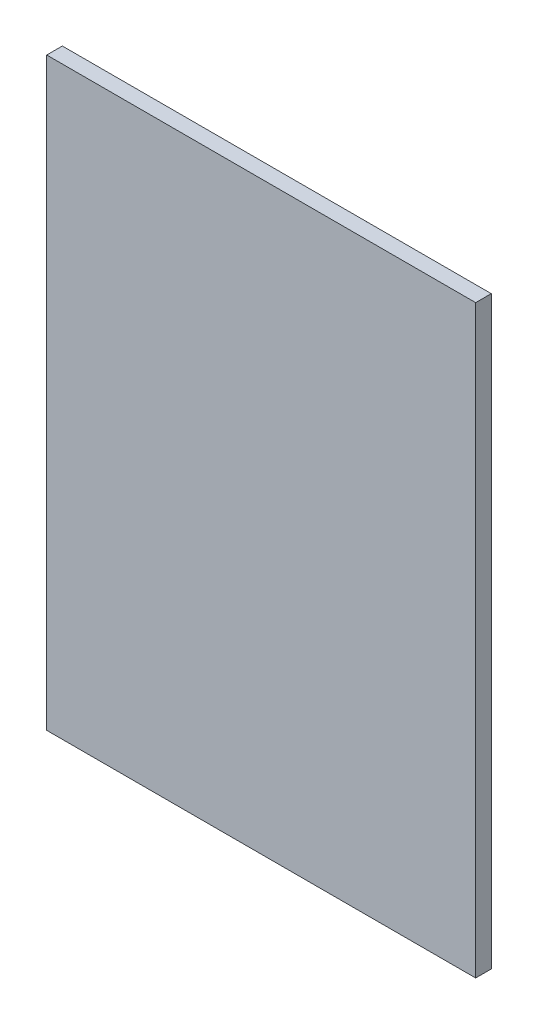
ISO-10303-21;
HEADER;
FILE_DESCRIPTION(('STEP AP214'),'2;1');
FILE_NAME('part.step','',(''),(''),'','','');
FILE_SCHEMA(('AUTOMOTIVE_DESIGN { 1 0 10303 214 1 1 1 1 }'));
ENDSEC;
DATA;
#1=APPLICATION_CONTEXT('core data for automotive mechanical design processes');
#2=APPLICATION_PROTOCOL_DEFINITION('international standard','automotive_design',2000,#1);
#3=PRODUCT_CONTEXT('',#1,'mechanical');
#4=PRODUCT('Part','Part','',(#3));
#5=PRODUCT_RELATED_PRODUCT_CATEGORY('part','',(#4));
#6=PRODUCT_DEFINITION_FORMATION('','',#4);
#7=PRODUCT_DEFINITION_CONTEXT('part definition',#1,'design');
#8=PRODUCT_DEFINITION('design','',#6,#7);
#9=PRODUCT_DEFINITION_SHAPE('','',#8);
#10=(LENGTH_UNIT() NAMED_UNIT(*) SI_UNIT(.MILLI.,.METRE.));
#11=(NAMED_UNIT(*) PLANE_ANGLE_UNIT() SI_UNIT($,.RADIAN.));
#12=(NAMED_UNIT(*) SI_UNIT($,.STERADIAN.) SOLID_ANGLE_UNIT());
#13=UNCERTAINTY_MEASURE_WITH_UNIT(LENGTH_MEASURE(1.E-05),#10,'distance_accuracy_value','');
#14=(GEOMETRIC_REPRESENTATION_CONTEXT(3) GLOBAL_UNCERTAINTY_ASSIGNED_CONTEXT((#13)) GLOBAL_UNIT_ASSIGNED_CONTEXT((#10,
#11,#12)) REPRESENTATION_CONTEXT('',''));
#15=CARTESIAN_POINT('',(0.,0.,0.));
#16=DIRECTION('',(0.,0.,1.));
#17=DIRECTION('',(1.,0.,0.));
#18=AXIS2_PLACEMENT_3D('',#15,#16,#17);
#19=CARTESIAN_POINT('',(0.,0.,4.));
#20=DIRECTION('',(1.,0.,0.));
#21=DIRECTION('',(0.,0.,-1.));
#22=AXIS2_PLACEMENT_3D('',#19,#20,#21);
#23=PLANE('',#22);
#24=DIRECTION('',(0.,-1.,0.));
#25=VECTOR('',#24,1.);
#26=CARTESIAN_POINT('',(0.,0.,0.));
#27=LINE('',#26,#25);
#28=CARTESIAN_POINT('',(0.,150.,0.));
#29=VERTEX_POINT('',#28);
#30=CARTESIAN_POINT('',(0.,0.,0.));
#31=VERTEX_POINT('',#30);
#32=EDGE_CURVE('E107',#29,#31,#27,.T.);
#33=ORIENTED_EDGE('',*,*,#32,.T.);
#34=DIRECTION('',(0.,0.,-1.));
#35=VECTOR('',#34,1.);
#36=CARTESIAN_POINT('',(0.,0.,4.));
#37=LINE('',#36,#35);
#38=CARTESIAN_POINT('',(0.,0.,4.));
#39=VERTEX_POINT('',#38);
#40=EDGE_CURVE('E11',#39,#31,#37,.T.);
#41=ORIENTED_EDGE('',*,*,#40,.F.);
#42=DIRECTION('',(0.,-1.,0.));
#43=VECTOR('',#42,1.);
#44=CARTESIAN_POINT('',(0.,0.,4.));
#45=LINE('',#44,#43);
#46=CARTESIAN_POINT('',(0.,150.,4.));
#47=VERTEX_POINT('',#46);
#48=EDGE_CURVE('E91',#47,#39,#45,.T.);
#49=ORIENTED_EDGE('',*,*,#48,.F.);
#50=DIRECTION('',(0.,0.,-1.));
#51=VECTOR('',#50,1.);
#52=CARTESIAN_POINT('',(0.,150.,4.));
#53=LINE('',#52,#51);
#54=EDGE_CURVE('E103',#47,#29,#53,.T.);
#55=ORIENTED_EDGE('',*,*,#54,.T.);
#56=EDGE_LOOP('',(#33,#41,#49,#55));
#57=FACE_BOUND('',#56,.T.);
#58=ADVANCED_FACE('F39',(#57),#23,.F.);
#59=CARTESIAN_POINT('',(0.,0.,4.));
#60=DIRECTION('',(0.,1.,0.));
#61=DIRECTION('',(0.,0.,1.));
#62=AXIS2_PLACEMENT_3D('',#59,#60,#61);
#63=PLANE('',#62);
#64=DIRECTION('',(1.,0.,0.));
#65=VECTOR('',#64,1.);
#66=CARTESIAN_POINT('',(0.,0.,0.));
#67=LINE('',#66,#65);
#68=CARTESIAN_POINT('',(110.,0.,0.));
#69=VERTEX_POINT('',#68);
#70=EDGE_CURVE('E96',#31,#69,#67,.T.);
#71=ORIENTED_EDGE('',*,*,#70,.T.);
#72=DIRECTION('',(0.,0.,-1.));
#73=VECTOR('',#72,1.);
#74=CARTESIAN_POINT('',(110.,0.,4.));
#75=LINE('',#74,#73);
#76=CARTESIAN_POINT('',(110.,0.,4.));
#77=VERTEX_POINT('',#76);
#78=EDGE_CURVE('E48',#77,#69,#75,.T.);
#79=ORIENTED_EDGE('',*,*,#78,.F.);
#80=DIRECTION('',(1.,0.,0.));
#81=VECTOR('',#80,1.);
#82=CARTESIAN_POINT('',(0.,0.,4.));
#83=LINE('',#82,#81);
#84=EDGE_CURVE('E86',#39,#77,#83,.T.);
#85=ORIENTED_EDGE('',*,*,#84,.F.);
#86=ORIENTED_EDGE('',*,*,#40,.T.);
#87=EDGE_LOOP('',(#71,#79,#85,#86));
#88=FACE_BOUND('',#87,.T.);
#89=ADVANCED_FACE('F95',(#88),#63,.F.);
#90=CARTESIAN_POINT('',(110.,0.,4.));
#91=DIRECTION('',(-1.,0.,0.));
#92=DIRECTION('',(0.,0.,1.));
#93=AXIS2_PLACEMENT_3D('',#90,#91,#92);
#94=PLANE('',#93);
#95=DIRECTION('',(0.,1.,0.));
#96=VECTOR('',#95,1.);
#97=CARTESIAN_POINT('',(110.,0.,0.));
#98=LINE('',#97,#96);
#99=CARTESIAN_POINT('',(110.,150.,0.));
#100=VERTEX_POINT('',#99);
#101=EDGE_CURVE('E73',#69,#100,#98,.T.);
#102=ORIENTED_EDGE('',*,*,#101,.T.);
#103=DIRECTION('',(0.,0.,-1.));
#104=VECTOR('',#103,1.);
#105=CARTESIAN_POINT('',(110.,150.,4.));
#106=LINE('',#105,#104);
#107=CARTESIAN_POINT('',(110.,150.,4.));
#108=VERTEX_POINT('',#107);
#109=EDGE_CURVE('E98',#108,#100,#106,.T.);
#110=ORIENTED_EDGE('',*,*,#109,.F.);
#111=DIRECTION('',(0.,1.,0.));
#112=VECTOR('',#111,1.);
#113=CARTESIAN_POINT('',(110.,0.,4.));
#114=LINE('',#113,#112);
#115=EDGE_CURVE('E89',#77,#108,#114,.T.);
#116=ORIENTED_EDGE('',*,*,#115,.F.);
#117=ORIENTED_EDGE('',*,*,#78,.T.);
#118=EDGE_LOOP('',(#102,#110,#116,#117));
#119=FACE_BOUND('',#118,.T.);
#120=ADVANCED_FACE('F99',(#119),#94,.F.);
#121=CARTESIAN_POINT('',(0.,150.,4.));
#122=DIRECTION('',(0.,-1.,0.));
#123=DIRECTION('',(0.,0.,-1.));
#124=AXIS2_PLACEMENT_3D('',#121,#122,#123);
#125=PLANE('',#124);
#126=DIRECTION('',(-1.,0.,0.));
#127=VECTOR('',#126,1.);
#128=CARTESIAN_POINT('',(0.,150.,0.));
#129=LINE('',#128,#127);
#130=EDGE_CURVE('E79',#100,#29,#129,.T.);
#131=ORIENTED_EDGE('',*,*,#130,.T.);
#132=ORIENTED_EDGE('',*,*,#54,.F.);
#133=DIRECTION('',(-1.,0.,0.));
#134=VECTOR('',#133,1.);
#135=CARTESIAN_POINT('',(0.,150.,4.));
#136=LINE('',#135,#134);
#137=EDGE_CURVE('E56',#108,#47,#136,.T.);
#138=ORIENTED_EDGE('',*,*,#137,.F.);
#139=ORIENTED_EDGE('',*,*,#109,.T.);
#140=EDGE_LOOP('',(#131,#132,#138,#139));
#141=FACE_BOUND('',#140,.T.);
#142=ADVANCED_FACE('F120',(#141),#125,.F.);
#143=CARTESIAN_POINT('',(0.,0.,4.));
#144=DIRECTION('',(0.,0.,-1.));
#145=DIRECTION('',(-1.,0.,0.));
#146=AXIS2_PLACEMENT_3D('',#143,#144,#145);
#147=PLANE('',#146);
#148=ORIENTED_EDGE('',*,*,#48,.T.);
#149=ORIENTED_EDGE('',*,*,#84,.T.);
#150=ORIENTED_EDGE('',*,*,#115,.T.);
#151=ORIENTED_EDGE('',*,*,#137,.T.);
#152=EDGE_LOOP('',(#148,#149,#150,#151));
#153=FACE_BOUND('',#152,.T.);
#154=ADVANCED_FACE('F87',(#153),#147,.F.);
#155=CARTESIAN_POINT('',(0.,0.,0.));
#156=DIRECTION('',(0.,0.,-1.));
#157=DIRECTION('',(-1.,0.,0.));
#158=AXIS2_PLACEMENT_3D('',#155,#156,#157);
#159=PLANE('',#158);
#160=ORIENTED_EDGE('',*,*,#32,.F.);
#161=ORIENTED_EDGE('',*,*,#130,.F.);
#162=ORIENTED_EDGE('',*,*,#101,.F.);
#163=ORIENTED_EDGE('',*,*,#70,.F.);
#164=EDGE_LOOP('',(#160,#161,#162,#163));
#165=FACE_BOUND('',#164,.T.);
#166=ADVANCED_FACE('F123',(#165),#159,.T.);
#167=CLOSED_SHELL('',(#58,#89,#120,#142,#154,#166));
#168=MANIFOLD_SOLID_BREP('B2',#167);
#169=ADVANCED_BREP_SHAPE_REPRESENTATION('',(#18,#168),#14);
#170=SHAPE_DEFINITION_REPRESENTATION(#9,#169);
ENDSEC;
END-ISO-10303-21;
